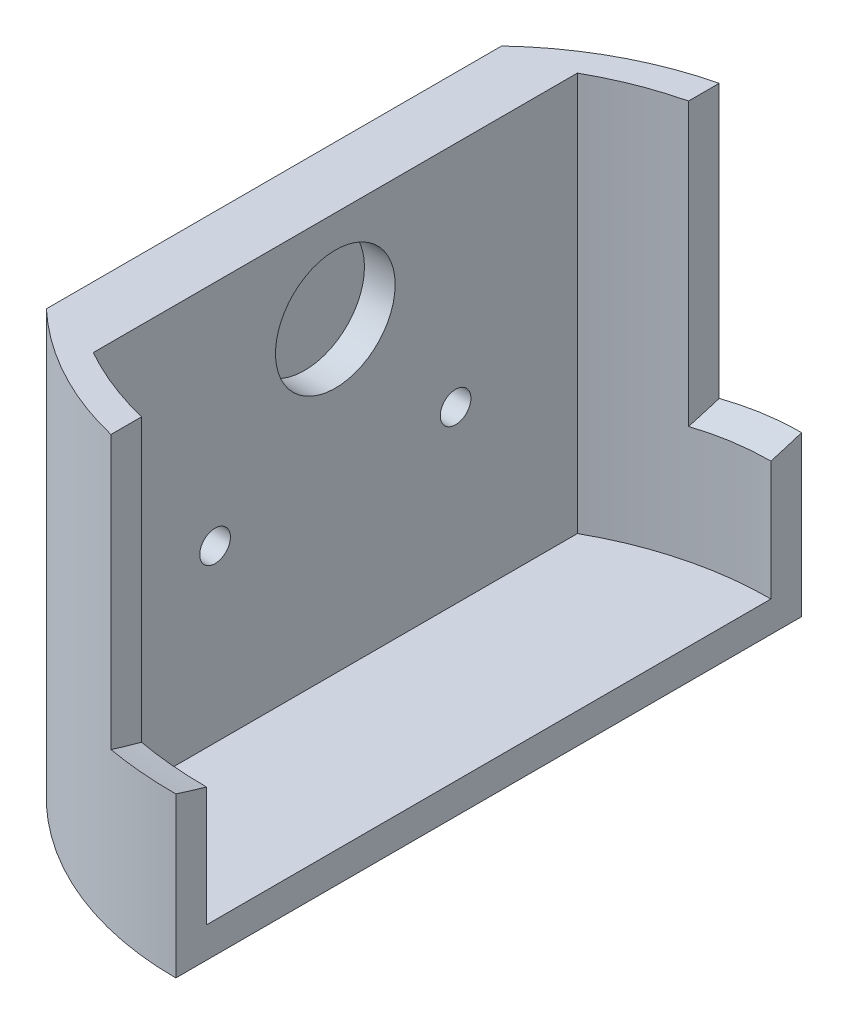
ISO-10303-21;
HEADER;
FILE_DESCRIPTION(('STEP AP214'),'2;1');
FILE_NAME('part.step','',(''),(''),'','','');
FILE_SCHEMA(('AUTOMOTIVE_DESIGN { 1 0 10303 214 1 1 1 1 }'));
ENDSEC;
DATA;
#1=APPLICATION_CONTEXT('core data for automotive mechanical design processes');
#2=APPLICATION_PROTOCOL_DEFINITION('international standard','automotive_design',2000,#1);
#3=PRODUCT_CONTEXT('',#1,'mechanical');
#4=PRODUCT('Part','Part','',(#3));
#5=PRODUCT_RELATED_PRODUCT_CATEGORY('part','',(#4));
#6=PRODUCT_DEFINITION_FORMATION('','',#4);
#7=PRODUCT_DEFINITION_CONTEXT('part definition',#1,'design');
#8=PRODUCT_DEFINITION('design','',#6,#7);
#9=PRODUCT_DEFINITION_SHAPE('','',#8);
#10=(LENGTH_UNIT() NAMED_UNIT(*) SI_UNIT(.MILLI.,.METRE.));
#11=(NAMED_UNIT(*) PLANE_ANGLE_UNIT() SI_UNIT($,.RADIAN.));
#12=(NAMED_UNIT(*) SI_UNIT($,.STERADIAN.) SOLID_ANGLE_UNIT());
#13=UNCERTAINTY_MEASURE_WITH_UNIT(LENGTH_MEASURE(1.E-05),#10,'distance_accuracy_value','');
#14=(GEOMETRIC_REPRESENTATION_CONTEXT(3) GLOBAL_UNCERTAINTY_ASSIGNED_CONTEXT((#13)) GLOBAL_UNIT_ASSIGNED_CONTEXT((#10,
#11,#12)) REPRESENTATION_CONTEXT('',''));
#15=CARTESIAN_POINT('',(0.,0.,0.));
#16=DIRECTION('',(0.,0.,1.));
#17=DIRECTION('',(1.,0.,0.));
#18=AXIS2_PLACEMENT_3D('',#15,#16,#17);
#19=CARTESIAN_POINT('',(0.,35.,0.));
#20=DIRECTION('',(0.,1.,0.));
#21=DIRECTION('',(0.,0.,1.));
#22=AXIS2_PLACEMENT_3D('',#19,#20,#21);
#23=PLANE('',#22);
#24=CARTESIAN_POINT('',(0.,35.,0.));
#25=DIRECTION('',(0.,1.,0.));
#26=DIRECTION('',(0.,0.,1.));
#27=AXIS2_PLACEMENT_3D('',#24,#25,#26);
#28=CIRCLE('',#27,51.);
#29=CARTESIAN_POINT('',(-35.,35.,37.0944739819828));
#30=VERTEX_POINT('',#29);
#31=CARTESIAN_POINT('',(-12.0000000000001,35.,49.5681349255749));
#32=VERTEX_POINT('',#31);
#33=EDGE_CURVE('E158',#30,#32,#28,.T.);
#34=ORIENTED_EDGE('',*,*,#33,.T.);
#35=DIRECTION('',(0.,0.,-1.));
#36=VECTOR('',#35,1.);
#37=CARTESIAN_POINT('',(-12.,35.,0.));
#38=LINE('',#37,#36);
#39=CARTESIAN_POINT('',(-12.0000000000001,35.,44.5681349255749));
#40=VERTEX_POINT('',#39);
#41=EDGE_CURVE('E11',#32,#40,#38,.T.);
#42=ORIENTED_EDGE('',*,*,#41,.T.);
#43=CARTESIAN_POINT('',(0.,35.,-5.00000000000011));
#44=DIRECTION('',(0.,1.,0.));
#45=DIRECTION('',(0.,0.,1.));
#46=AXIS2_PLACEMENT_3D('',#43,#44,#45);
#47=CIRCLE('',#46,51.0000000000001);
#48=CARTESIAN_POINT('',(-25.,35.,39.4522215417857));
#49=VERTEX_POINT('',#48);
#50=EDGE_CURVE('E204',#49,#40,#47,.T.);
#51=ORIENTED_EDGE('',*,*,#50,.F.);
#52=DIRECTION('',(0.,0.,1.));
#53=VECTOR('',#52,1.);
#54=CARTESIAN_POINT('',(-25.,35.,0.));
#55=LINE('',#54,#53);
#56=CARTESIAN_POINT('',(-25.,35.,-39.4522215417857));
#57=VERTEX_POINT('',#56);
#58=EDGE_CURVE('E192',#57,#49,#55,.T.);
#59=ORIENTED_EDGE('',*,*,#58,.F.);
#60=CARTESIAN_POINT('',(0.,35.,5.00000000000012));
#61=DIRECTION('',(0.,1.,0.));
#62=DIRECTION('',(0.,0.,1.));
#63=AXIS2_PLACEMENT_3D('',#60,#61,#62);
#64=CIRCLE('',#63,51.0000000000001);
#65=CARTESIAN_POINT('',(-11.9999999999999,35.,-44.5681349255749));
#66=VERTEX_POINT('',#65);
#67=EDGE_CURVE('E182',#57,#66,#64,.F.);
#68=ORIENTED_EDGE('',*,*,#67,.T.);
#69=CARTESIAN_POINT('',(-11.9999999999999,35.,-49.568134925575));
#70=VERTEX_POINT('',#69);
#71=EDGE_CURVE('E42',#66,#70,#38,.T.);
#72=ORIENTED_EDGE('',*,*,#71,.T.);
#73=CARTESIAN_POINT('',(0.,35.,0.));
#74=DIRECTION('',(0.,1.,0.));
#75=DIRECTION('',(0.,0.,1.));
#76=AXIS2_PLACEMENT_3D('',#73,#74,#75);
#77=CIRCLE('',#76,51.);
#78=CARTESIAN_POINT('',(-35.,35.,-37.0944739819828));
#79=VERTEX_POINT('',#78);
#80=EDGE_CURVE('E178',#70,#79,#77,.T.);
#81=ORIENTED_EDGE('',*,*,#80,.T.);
#82=DIRECTION('',(0.,0.,1.));
#83=VECTOR('',#82,1.);
#84=CARTESIAN_POINT('',(-35.,35.,0.));
#85=LINE('',#84,#83);
#86=EDGE_CURVE('E189',#79,#30,#85,.T.);
#87=ORIENTED_EDGE('',*,*,#86,.T.);
#88=EDGE_LOOP('',(#34,#42,#51,#59,#68,#72,#81,#87));
#89=FACE_BOUND('',#88,.T.);
#90=ADVANCED_FACE('F37',(#89),#23,.T.);
#91=CARTESIAN_POINT('',(0.,35.,-5.00000000000011));
#92=DIRECTION('',(0.,-1.,0.));
#93=DIRECTION('',(0.,0.,-1.));
#94=AXIS2_PLACEMENT_3D('',#91,#92,#93);
#95=CYLINDRICAL_SURFACE('',#94,51.0000000000001);
#96=CARTESIAN_POINT('',(0.,-10.5397147125907,46.));
#97=CARTESIAN_POINT('',(-1.01212666729296,-10.5396649263667,46.000046785484));
#98=CARTESIAN_POINT('',(-2.02424113794272,-10.5483477629724,45.9698708668592));
#99=CARTESIAN_POINT('',(-4.04078435592302,-10.5827391344307,45.8496532403654));
#100=CARTESIAN_POINT('',(-5.0452276935598,-10.6083832870093,45.7598379085058));
#101=CARTESIAN_POINT('',(-7.04645854770597,-10.6762630245179,45.5209160571074));
#102=CARTESIAN_POINT('',(-8.04324611476283,-10.718498499807,45.3718099293815));
#103=CARTESIAN_POINT('',(-10.0292422599076,-10.8189618364022,45.0143703287444));
#104=CARTESIAN_POINT('',(-11.0184078177535,-10.8772496793075,44.8058146107468));
#105=CARTESIAN_POINT('',(-12.0000000000001,-10.9430997255109,44.5681349255749));
#106=B_SPLINE_CURVE_WITH_KNOTS('',3,(#96,#97,#98,#99,#100,#101,#102,#103,#104,#105),
.UNSPECIFIED.,.F.,.F.,(4,2,2,2,4),(0.,3.0358740493823,6.06029006734916,9.0846860993236,
12.1205401790147),.UNSPECIFIED.);
#107=CARTESIAN_POINT('',(-1.0928748035591E-13,-10.5397147125907,46.));
#108=VERTEX_POINT('',#107);
#109=CARTESIAN_POINT('',(-12.0000000000001,-10.9430997255109,44.5681349255749));
#110=VERTEX_POINT('',#109);
#111=EDGE_CURVE('E230',#108,#110,#106,.T.);
#112=ORIENTED_EDGE('',*,*,#111,.F.);
#113=DIRECTION('',(0.,-1.,0.));
#114=VECTOR('',#113,1.);
#115=CARTESIAN_POINT('',(0.,35.,46.));
#116=LINE('',#115,#114);
#117=CARTESIAN_POINT('',(0.,-30.,46.));
#118=VERTEX_POINT('',#117);
#119=EDGE_CURVE('E146',#108,#118,#116,.T.);
#120=ORIENTED_EDGE('',*,*,#119,.T.);
#121=CARTESIAN_POINT('',(0.,-30.,-5.00000000000011));
#122=DIRECTION('',(0.,-1.,0.));
#123=DIRECTION('',(0.,0.,-1.));
#124=AXIS2_PLACEMENT_3D('',#121,#122,#123);
#125=CIRCLE('',#124,51.0000000000001);
#126=CARTESIAN_POINT('',(-25.,-30.,39.4522215417857));
#127=VERTEX_POINT('',#126);
#128=EDGE_CURVE('E200',#118,#127,#125,.T.);
#129=ORIENTED_EDGE('',*,*,#128,.T.);
#130=DIRECTION('',(0.,-1.,0.));
#131=VECTOR('',#130,1.);
#132=CARTESIAN_POINT('',(-25.,35.,39.4522215417857));
#133=LINE('',#132,#131);
#134=EDGE_CURVE('E169',#49,#127,#133,.T.);
#135=ORIENTED_EDGE('',*,*,#134,.F.);
#136=ORIENTED_EDGE('',*,*,#50,.T.);
#137=DIRECTION('',(0.,-1.,0.));
#138=VECTOR('',#137,1.);
#139=CARTESIAN_POINT('',(-12.0000000000001,35.,44.5681349255749));
#140=LINE('',#139,#138);
#141=EDGE_CURVE('E61',#40,#110,#140,.T.);
#142=ORIENTED_EDGE('',*,*,#141,.T.);
#143=EDGE_LOOP('',(#112,#120,#129,#135,#136,#142));
#144=FACE_BOUND('',#143,.T.);
#145=ADVANCED_FACE('F39',(#144),#95,.F.);
#146=CARTESIAN_POINT('',(-25.,35.,0.));
#147=DIRECTION('',(1.,0.,0.));
#148=DIRECTION('',(0.,0.,-1.));
#149=AXIS2_PLACEMENT_3D('',#146,#147,#148);
#150=PLANE('',#149);
#151=CARTESIAN_POINT('',(-25.,20.,0.));
#152=DIRECTION('',(1.,0.,0.));
#153=DIRECTION('',(0.,0.,-1.));
#154=AXIS2_PLACEMENT_3D('',#151,#152,#153);
#155=CIRCLE('',#154,9.75);
#156=CARTESIAN_POINT('',(-25.,20.,-9.75));
#157=VERTEX_POINT('',#156);
#158=EDGE_CURVE('E320',#157,#157,#155,.T.);
#159=ORIENTED_EDGE('',*,*,#158,.F.);
#160=EDGE_LOOP('',(#159));
#161=FACE_BOUND('',#160,.T.);
#162=CARTESIAN_POINT('',(-25.,-2.21,-19.6));
#163=DIRECTION('',(1.,0.,0.));
#164=DIRECTION('',(0.,0.,-1.));
#165=AXIS2_PLACEMENT_3D('',#162,#163,#164);
#166=CIRCLE('',#165,2.5);
#167=CARTESIAN_POINT('',(-25.,-2.21,-22.1));
#168=VERTEX_POINT('',#167);
#169=EDGE_CURVE('E224',#168,#168,#166,.T.);
#170=ORIENTED_EDGE('',*,*,#169,.F.);
#171=EDGE_LOOP('',(#170));
#172=FACE_BOUND('',#171,.T.);
#173=CARTESIAN_POINT('',(-25.,-2.21,19.6));
#174=DIRECTION('',(1.,0.,0.));
#175=DIRECTION('',(0.,0.,-1.));
#176=AXIS2_PLACEMENT_3D('',#173,#174,#175);
#177=CIRCLE('',#176,2.5);
#178=CARTESIAN_POINT('',(-25.,-2.21,17.1));
#179=VERTEX_POINT('',#178);
#180=EDGE_CURVE('E221',#179,#179,#177,.T.);
#181=ORIENTED_EDGE('',*,*,#180,.F.);
#182=EDGE_LOOP('',(#181));
#183=FACE_BOUND('',#182,.T.);
#184=ORIENTED_EDGE('',*,*,#134,.T.);
#185=DIRECTION('',(0.,0.,-1.));
#186=VECTOR('',#185,1.);
#187=CARTESIAN_POINT('',(-25.,-30.,0.));
#188=LINE('',#187,#186);
#189=CARTESIAN_POINT('',(-25.,-30.,-39.4522215417857));
#190=VERTEX_POINT('',#189);
#191=EDGE_CURVE('E213',#127,#190,#188,.T.);
#192=ORIENTED_EDGE('',*,*,#191,.T.);
#193=DIRECTION('',(0.,-1.,0.));
#194=VECTOR('',#193,1.);
#195=CARTESIAN_POINT('',(-25.,35.,-39.4522215417857));
#196=LINE('',#195,#194);
#197=EDGE_CURVE('E167',#57,#190,#196,.T.);
#198=ORIENTED_EDGE('',*,*,#197,.F.);
#199=ORIENTED_EDGE('',*,*,#58,.T.);
#200=EDGE_LOOP('',(#184,#192,#198,#199));
#201=FACE_BOUND('',#200,.T.);
#202=ADVANCED_FACE('F274',(#161,#172,#183,#201),#150,.T.);
#203=CARTESIAN_POINT('',(0.,35.,5.00000000000012));
#204=DIRECTION('',(0.,-1.,0.));
#205=DIRECTION('',(0.,0.,-1.));
#206=AXIS2_PLACEMENT_3D('',#203,#204,#205);
#207=CYLINDRICAL_SURFACE('',#206,51.0000000000001);
#208=DIRECTION('',(0.,-1.,0.));
#209=VECTOR('',#208,1.);
#210=CARTESIAN_POINT('',(0.,35.,-46.));
#211=LINE('',#210,#209);
#212=CARTESIAN_POINT('',(1.0928748035591E-13,-10.5397147125907,-46.));
#213=VERTEX_POINT('',#212);
#214=CARTESIAN_POINT('',(0.,-30.,-46.));
#215=VERTEX_POINT('',#214);
#216=EDGE_CURVE('E165',#213,#215,#211,.T.);
#217=ORIENTED_EDGE('',*,*,#216,.F.);
#218=CARTESIAN_POINT('',(0.,-10.5397147125907,-46.));
#219=CARTESIAN_POINT('',(-1.01212666729297,-10.5396649263668,-46.0000467854839));
#220=CARTESIAN_POINT('',(-2.02424113794271,-10.5483477629724,-45.9698708668592));
#221=CARTESIAN_POINT('',(-4.04078435592297,-10.5827391344307,-45.8496532403654));
#222=CARTESIAN_POINT('',(-5.04522769355972,-10.6083832870093,-45.7598379085058));
#223=CARTESIAN_POINT('',(-7.04645854770586,-10.6762630245179,-45.5209160571075));
#224=CARTESIAN_POINT('',(-8.0432461147627,-10.718498499807,-45.3718099293816));
#225=CARTESIAN_POINT('',(-10.0292422599074,-10.8189618364022,-45.0143703287444));
#226=CARTESIAN_POINT('',(-11.0184078177533,-10.8772496793075,-44.8058146107468));
#227=CARTESIAN_POINT('',(-11.9999999999999,-10.9430997255109,-44.5681349255749));
#228=B_SPLINE_CURVE_WITH_KNOTS('',3,(#218,#219,#220,#221,#222,#223,#224,#225,#226,#227),
.UNSPECIFIED.,.F.,.F.,(4,2,2,2,4),(0.,3.03587404938223,6.06029006734904,9.08468609932341,
12.1205401790145),.UNSPECIFIED.);
#229=CARTESIAN_POINT('',(-11.9999999999999,-10.9430997255109,-44.5681349255749));
#230=VERTEX_POINT('',#229);
#231=EDGE_CURVE('E238',#213,#230,#228,.T.);
#232=ORIENTED_EDGE('',*,*,#231,.T.);
#233=DIRECTION('',(0.,-1.,0.));
#234=VECTOR('',#233,1.);
#235=CARTESIAN_POINT('',(-11.9999999999999,35.,-44.5681349255749));
#236=LINE('',#235,#234);
#237=EDGE_CURVE('E317',#66,#230,#236,.T.);
#238=ORIENTED_EDGE('',*,*,#237,.F.);
#239=ORIENTED_EDGE('',*,*,#67,.F.);
#240=ORIENTED_EDGE('',*,*,#197,.T.);
#241=CARTESIAN_POINT('',(0.,-30.,5.00000000000012));
#242=DIRECTION('',(0.,-1.,0.));
#243=DIRECTION('',(0.,0.,-1.));
#244=AXIS2_PLACEMENT_3D('',#241,#242,#243);
#245=CIRCLE('',#244,51.0000000000001);
#246=EDGE_CURVE('E215',#215,#190,#245,.F.);
#247=ORIENTED_EDGE('',*,*,#246,.F.);
#248=EDGE_LOOP('',(#217,#232,#238,#239,#240,#247));
#249=FACE_BOUND('',#248,.T.);
#250=ADVANCED_FACE('F271',(#249),#207,.F.);
#251=CARTESIAN_POINT('',(0.,35.,0.));
#252=DIRECTION('',(0.,-1.,0.));
#253=DIRECTION('',(0.,0.,-1.));
#254=AXIS2_PLACEMENT_3D('',#251,#252,#253);
#255=CYLINDRICAL_SURFACE('',#254,51.);
#256=DIRECTION('',(0.,-1.,0.));
#257=VECTOR('',#256,1.);
#258=CARTESIAN_POINT('',(-11.9999999999999,35.,-49.568134925575));
#259=LINE('',#258,#257);
#260=CARTESIAN_POINT('',(-11.9999999999999,-9.47413583399659,-49.568134925575));
#261=VERTEX_POINT('',#260);
#262=EDGE_CURVE('E53',#261,#70,#259,.F.);
#263=ORIENTED_EDGE('',*,*,#262,.F.);
#264=CARTESIAN_POINT('',(-11.9999999999999,-9.47413583399659,-49.568134925575));
#265=CARTESIAN_POINT('',(-11.0187112812139,-9.40024670806549,-49.8057425278275));
#266=CARTESIAN_POINT('',(-10.029754786055,-9.33488450134017,-50.0142660983863));
#267=CARTESIAN_POINT('',(-8.04404278182525,-9.22227224124399,-50.3716784635086));
#268=CARTESIAN_POINT('',(-7.04733183091364,-9.17495356991025,-50.5207932832916));
#269=CARTESIAN_POINT('',(-5.04604258320943,-9.098906030237,-50.7597591208243));
#270=CARTESIAN_POINT('',(-4.0414642234755,-9.07017731077604,-50.8496096639533));
#271=CARTESIAN_POINT('',(-2.5298521156747,-9.04133057275696,-50.939730050804));
#272=CARTESIAN_POINT('',(-2.02418633564615,-9.03408926252952,-50.9623277897414));
#273=CARTESIAN_POINT('',(-1.01235826531961,-9.02442831421355,-50.992463156473));
#274=CARTESIAN_POINT('',(-0.50619597308539,-9.02200869500345,-51.0000007253019));
#275=CARTESIAN_POINT('',(0.,-9.02201105507375,-51.));
#276=B_SPLINE_CURVE_WITH_KNOTS('',3,(#264,#265,#266,#267,#268,#269,#270,#271,#272,#273,#274,
#275),.UNSPECIFIED.,.F.,.F.,(4,2,2,2,2,4),(0.,3.03651662250019,6.06136765875275,
9.08624291937569,10.6046958249614,12.1231546757575),.UNSPECIFIED.);
#277=CARTESIAN_POINT('',(1.21166554307639E-13,-9.02201105507375,-51.));
#278=VERTEX_POINT('',#277);
#279=EDGE_CURVE('E137',#261,#278,#276,.T.);
#280=ORIENTED_EDGE('',*,*,#279,.T.);
#281=DIRECTION('',(0.,-1.,0.));
#282=VECTOR('',#281,1.);
#283=CARTESIAN_POINT('',(0.,35.,-51.));
#284=LINE('',#283,#282);
#285=CARTESIAN_POINT('',(0.,-35.,-51.));
#286=VERTEX_POINT('',#285);
#287=EDGE_CURVE('E163',#278,#286,#284,.T.);
#288=ORIENTED_EDGE('',*,*,#287,.T.);
#289=CARTESIAN_POINT('',(0.,-35.,0.));
#290=DIRECTION('',(0.,1.,0.));
#291=DIRECTION('',(0.,0.,1.));
#292=AXIS2_PLACEMENT_3D('',#289,#290,#291);
#293=CIRCLE('',#292,51.);
#294=CARTESIAN_POINT('',(-35.,-35.,-37.0944739819828));
#295=VERTEX_POINT('',#294);
#296=EDGE_CURVE('E197',#286,#295,#293,.T.);
#297=ORIENTED_EDGE('',*,*,#296,.T.);
#298=DIRECTION('',(0.,-1.,0.));
#299=VECTOR('',#298,1.);
#300=CARTESIAN_POINT('',(-35.,35.,-37.0944739819828));
#301=LINE('',#300,#299);
#302=EDGE_CURVE('E156',#79,#295,#301,.T.);
#303=ORIENTED_EDGE('',*,*,#302,.F.);
#304=ORIENTED_EDGE('',*,*,#80,.F.);
#305=EDGE_LOOP('',(#263,#280,#288,#297,#303,#304));
#306=FACE_BOUND('',#305,.T.);
#307=ADVANCED_FACE('F185',(#306),#255,.T.);
#308=CARTESIAN_POINT('',(-35.,35.,0.));
#309=DIRECTION('',(1.,0.,0.));
#310=DIRECTION('',(0.,0.,-1.));
#311=AXIS2_PLACEMENT_3D('',#308,#309,#310);
#312=PLANE('',#311);
#313=DIRECTION('',(0.,0.,1.));
#314=VECTOR('',#313,1.);
#315=CARTESIAN_POINT('',(-35.,-35.,0.));
#316=LINE('',#315,#314);
#317=CARTESIAN_POINT('',(-35.,-35.,37.0944739819828));
#318=VERTEX_POINT('',#317);
#319=EDGE_CURVE('E199',#295,#318,#316,.T.);
#320=ORIENTED_EDGE('',*,*,#319,.T.);
#321=DIRECTION('',(0.,-1.,0.));
#322=VECTOR('',#321,1.);
#323=CARTESIAN_POINT('',(-35.,35.,37.0944739819828));
#324=LINE('',#323,#322);
#325=EDGE_CURVE('E154',#30,#318,#324,.T.);
#326=ORIENTED_EDGE('',*,*,#325,.F.);
#327=ORIENTED_EDGE('',*,*,#86,.F.);
#328=ORIENTED_EDGE('',*,*,#302,.T.);
#329=EDGE_LOOP('',(#320,#326,#327,#328));
#330=FACE_BOUND('',#329,.T.);
#331=ADVANCED_FACE('F270',(#330),#312,.F.);
#332=CARTESIAN_POINT('',(0.,35.,0.));
#333=DIRECTION('',(0.,-1.,0.));
#334=DIRECTION('',(0.,0.,-1.));
#335=AXIS2_PLACEMENT_3D('',#332,#333,#334);
#336=CYLINDRICAL_SURFACE('',#335,51.);
#337=DIRECTION('',(0.,-1.,0.));
#338=VECTOR('',#337,1.);
#339=CARTESIAN_POINT('',(0.,35.,51.));
#340=LINE('',#339,#338);
#341=CARTESIAN_POINT('',(-1.21166554307639E-13,-9.02201105507375,51.));
#342=VERTEX_POINT('',#341);
#343=CARTESIAN_POINT('',(0.,-35.,51.));
#344=VERTEX_POINT('',#343);
#345=EDGE_CURVE('E143',#342,#344,#340,.T.);
#346=ORIENTED_EDGE('',*,*,#345,.F.);
#347=CARTESIAN_POINT('',(0.,-9.02201105507375,51.));
#348=CARTESIAN_POINT('',(-0.506195973085392,-9.02200869500345,51.0000007253019));
#349=CARTESIAN_POINT('',(-1.01235826531963,-9.02442831421355,50.992463156473));
#350=CARTESIAN_POINT('',(-2.02418633564618,-9.03408926252952,50.9623277897414));
#351=CARTESIAN_POINT('',(-2.52985211567474,-9.04133057275695,50.939730050804));
#352=CARTESIAN_POINT('',(-4.04146422347557,-9.07017731077603,50.8496096639533));
#353=CARTESIAN_POINT('',(-5.04604258320952,-9.09890603023699,50.7597591208243));
#354=CARTESIAN_POINT('',(-7.04733183091377,-9.17495356991025,50.5207932832916));
#355=CARTESIAN_POINT('',(-8.0440427818254,-9.22227224124399,50.3716784635086));
#356=CARTESIAN_POINT('',(-10.0297547860552,-9.33488450134017,50.0142660983863));
#357=CARTESIAN_POINT('',(-11.0187112812141,-9.40024670806549,49.8057425278274));
#358=CARTESIAN_POINT('',(-12.0000000000001,-9.47413583399659,49.5681349255749));
#359=B_SPLINE_CURVE_WITH_KNOTS('',3,(#347,#348,#349,#350,#351,#352,#353,#354,#355,#356,#357,
#358),.UNSPECIFIED.,.F.,.F.,(4,2,2,2,2,4),(0.,1.51845885079609,3.03691175638185,
6.06178701700485,9.08663805325746,12.1231546757577),.UNSPECIFIED.);
#360=CARTESIAN_POINT('',(-12.0000000000001,-9.47413583399659,49.5681349255749));
#361=VERTEX_POINT('',#360);
#362=EDGE_CURVE('E128',#342,#361,#359,.T.);
#363=ORIENTED_EDGE('',*,*,#362,.T.);
#364=DIRECTION('',(0.,-1.,0.));
#365=VECTOR('',#364,1.);
#366=CARTESIAN_POINT('',(-12.0000000000001,35.,49.5681349255749));
#367=LINE('',#366,#365);
#368=EDGE_CURVE('E315',#32,#361,#367,.T.);
#369=ORIENTED_EDGE('',*,*,#368,.F.);
#370=ORIENTED_EDGE('',*,*,#33,.F.);
#371=ORIENTED_EDGE('',*,*,#325,.T.);
#372=CARTESIAN_POINT('',(0.,-35.,0.));
#373=DIRECTION('',(0.,1.,0.));
#374=DIRECTION('',(0.,0.,1.));
#375=AXIS2_PLACEMENT_3D('',#372,#373,#374);
#376=CIRCLE('',#375,51.);
#377=EDGE_CURVE('E152',#318,#344,#376,.T.);
#378=ORIENTED_EDGE('',*,*,#377,.T.);
#379=EDGE_LOOP('',(#346,#363,#369,#370,#371,#378));
#380=FACE_BOUND('',#379,.T.);
#381=ADVANCED_FACE('F150',(#380),#336,.T.);
#382=CARTESIAN_POINT('',(1.21166554307639E-13,35.,0.));
#383=DIRECTION('',(1.,0.,0.));
#384=DIRECTION('',(0.,0.,-1.));
#385=AXIS2_PLACEMENT_3D('',#382,#383,#384);
#386=PLANE('',#385);
#387=CARTESIAN_POINT('',(0.,150.,0.));
#388=DIRECTION('',(1.,0.,0.));
#389=DIRECTION('',(0.,0.,-1.));
#390=AXIS2_PLACEMENT_3D('',#387,#388,#389);
#391=CIRCLE('',#390,167.);
#392=EDGE_CURVE('E131',#342,#108,#391,.T.);
#393=ORIENTED_EDGE('',*,*,#392,.F.);
#394=ORIENTED_EDGE('',*,*,#345,.T.);
#395=DIRECTION('',(0.,0.,1.));
#396=VECTOR('',#395,1.);
#397=CARTESIAN_POINT('',(1.21166554307639E-13,-35.,0.));
#398=LINE('',#397,#396);
#399=EDGE_CURVE('E203',#286,#344,#398,.T.);
#400=ORIENTED_EDGE('',*,*,#399,.F.);
#401=ORIENTED_EDGE('',*,*,#287,.F.);
#402=EDGE_CURVE('E148',#213,#278,#391,.T.);
#403=ORIENTED_EDGE('',*,*,#402,.F.);
#404=ORIENTED_EDGE('',*,*,#216,.T.);
#405=DIRECTION('',(0.,0.,1.));
#406=VECTOR('',#405,1.);
#407=CARTESIAN_POINT('',(0.,-30.,51.));
#408=LINE('',#407,#406);
#409=EDGE_CURVE('E218',#215,#118,#408,.T.);
#410=ORIENTED_EDGE('',*,*,#409,.T.);
#411=ORIENTED_EDGE('',*,*,#119,.F.);
#412=EDGE_LOOP('',(#393,#394,#400,#401,#403,#404,#410,#411));
#413=FACE_BOUND('',#412,.T.);
#414=ADVANCED_FACE('F141',(#413),#386,.T.);
#415=CARTESIAN_POINT('',(0.,-35.,0.));
#416=DIRECTION('',(0.,1.,0.));
#417=DIRECTION('',(0.,0.,1.));
#418=AXIS2_PLACEMENT_3D('',#415,#416,#417);
#419=PLANE('',#418);
#420=ORIENTED_EDGE('',*,*,#296,.F.);
#421=ORIENTED_EDGE('',*,*,#399,.T.);
#422=ORIENTED_EDGE('',*,*,#377,.F.);
#423=ORIENTED_EDGE('',*,*,#319,.F.);
#424=EDGE_LOOP('',(#420,#421,#422,#423));
#425=FACE_BOUND('',#424,.T.);
#426=ADVANCED_FACE('F291',(#425),#419,.F.);
#427=CARTESIAN_POINT('',(0.,-30.,0.));
#428=DIRECTION('',(0.,-1.,0.));
#429=DIRECTION('',(0.,0.,-1.));
#430=AXIS2_PLACEMENT_3D('',#427,#428,#429);
#431=PLANE('',#430);
#432=ORIENTED_EDGE('',*,*,#128,.F.);
#433=ORIENTED_EDGE('',*,*,#409,.F.);
#434=ORIENTED_EDGE('',*,*,#246,.T.);
#435=ORIENTED_EDGE('',*,*,#191,.F.);
#436=EDGE_LOOP('',(#432,#433,#434,#435));
#437=FACE_BOUND('',#436,.T.);
#438=ADVANCED_FACE('F289',(#437),#431,.F.);
#439=CARTESIAN_POINT('',(-30.,-2.21,19.6));
#440=DIRECTION('',(1.,0.,0.));
#441=DIRECTION('',(0.,0.,-1.));
#442=AXIS2_PLACEMENT_3D('',#439,#440,#441);
#443=CYLINDRICAL_SURFACE('',#442,2.5);
#444=CARTESIAN_POINT('',(-30.,-2.21,19.6));
#445=DIRECTION('',(1.,0.,0.));
#446=DIRECTION('',(0.,0.,-1.));
#447=AXIS2_PLACEMENT_3D('',#444,#445,#446);
#448=CIRCLE('',#447,2.5);
#449=CARTESIAN_POINT('',(-30.,-2.21,17.1));
#450=VERTEX_POINT('',#449);
#451=EDGE_CURVE('E220',#450,#450,#448,.T.);
#452=ORIENTED_EDGE('',*,*,#451,.F.);
#453=EDGE_LOOP('',(#452));
#454=FACE_BOUND('',#453,.T.);
#455=ORIENTED_EDGE('',*,*,#180,.T.);
#456=EDGE_LOOP('',(#455));
#457=FACE_BOUND('',#456,.T.);
#458=ADVANCED_FACE('F414',(#454,#457),#443,.F.);
#459=CARTESIAN_POINT('',(-30.,-2.21,19.6));
#460=DIRECTION('',(1.,0.,0.));
#461=DIRECTION('',(0.,0.,-1.));
#462=AXIS2_PLACEMENT_3D('',#459,#460,#461);
#463=PLANE('',#462);
#464=ORIENTED_EDGE('',*,*,#451,.T.);
#465=EDGE_LOOP('',(#464));
#466=FACE_BOUND('',#465,.T.);
#467=ADVANCED_FACE('F405',(#466),#463,.T.);
#468=CARTESIAN_POINT('',(-30.,-2.21,-19.6));
#469=DIRECTION('',(1.,0.,0.));
#470=DIRECTION('',(0.,0.,-1.));
#471=AXIS2_PLACEMENT_3D('',#468,#469,#470);
#472=CYLINDRICAL_SURFACE('',#471,2.5);
#473=CARTESIAN_POINT('',(-30.,-2.21,-19.6));
#474=DIRECTION('',(1.,0.,0.));
#475=DIRECTION('',(0.,0.,-1.));
#476=AXIS2_PLACEMENT_3D('',#473,#474,#475);
#477=CIRCLE('',#476,2.5);
#478=CARTESIAN_POINT('',(-30.,-2.21,-22.1));
#479=VERTEX_POINT('',#478);
#480=EDGE_CURVE('E227',#479,#479,#477,.T.);
#481=ORIENTED_EDGE('',*,*,#480,.F.);
#482=EDGE_LOOP('',(#481));
#483=FACE_BOUND('',#482,.T.);
#484=ORIENTED_EDGE('',*,*,#169,.T.);
#485=EDGE_LOOP('',(#484));
#486=FACE_BOUND('',#485,.T.);
#487=ADVANCED_FACE('F253',(#483,#486),#472,.F.);
#488=CARTESIAN_POINT('',(-30.,-2.21,-19.6));
#489=DIRECTION('',(1.,0.,0.));
#490=DIRECTION('',(0.,0.,-1.));
#491=AXIS2_PLACEMENT_3D('',#488,#489,#490);
#492=PLANE('',#491);
#493=ORIENTED_EDGE('',*,*,#480,.T.);
#494=EDGE_LOOP('',(#493));
#495=FACE_BOUND('',#494,.T.);
#496=ADVANCED_FACE('F326',(#495),#492,.T.);
#497=CARTESIAN_POINT('',(-12.,0.,0.));
#498=DIRECTION('',(1.,0.,0.));
#499=DIRECTION('',(0.,0.,-1.));
#500=AXIS2_PLACEMENT_3D('',#497,#498,#499);
#501=PLANE('',#500);
#502=ORIENTED_EDGE('',*,*,#237,.T.);
#503=CARTESIAN_POINT('',(-12.,150.,0.));
#504=DIRECTION('',(1.,0.,0.));
#505=DIRECTION('',(0.,0.,-1.));
#506=AXIS2_PLACEMENT_3D('',#503,#504,#505);
#507=CIRCLE('',#506,167.);
#508=EDGE_CURVE('E147',#230,#261,#507,.T.);
#509=ORIENTED_EDGE('',*,*,#508,.T.);
#510=ORIENTED_EDGE('',*,*,#262,.T.);
#511=ORIENTED_EDGE('',*,*,#71,.F.);
#512=EDGE_LOOP('',(#502,#509,#510,#511));
#513=FACE_BOUND('',#512,.T.);
#514=ADVANCED_FACE('F249',(#513),#501,.T.);
#515=CARTESIAN_POINT('',(-12.,150.,0.));
#516=DIRECTION('',(1.,0.,0.));
#517=DIRECTION('',(0.,0.,-1.));
#518=AXIS2_PLACEMENT_3D('',#515,#516,#517);
#519=CYLINDRICAL_SURFACE('',#518,167.);
#520=ORIENTED_EDGE('',*,*,#402,.T.);
#521=ORIENTED_EDGE('',*,*,#279,.F.);
#522=ORIENTED_EDGE('',*,*,#508,.F.);
#523=ORIENTED_EDGE('',*,*,#231,.F.);
#524=EDGE_LOOP('',(#520,#521,#522,#523));
#525=FACE_BOUND('',#524,.T.);
#526=ADVANCED_FACE('F244',(#525),#519,.F.);
#527=ORIENTED_EDGE('',*,*,#111,.T.);
#528=EDGE_CURVE('E133',#361,#110,#507,.T.);
#529=ORIENTED_EDGE('',*,*,#528,.F.);
#530=ORIENTED_EDGE('',*,*,#362,.F.);
#531=ORIENTED_EDGE('',*,*,#392,.T.);
#532=EDGE_LOOP('',(#527,#529,#530,#531));
#533=FACE_BOUND('',#532,.T.);
#534=ADVANCED_FACE('F130',(#533),#519,.F.);
#535=ORIENTED_EDGE('',*,*,#41,.F.);
#536=ORIENTED_EDGE('',*,*,#368,.T.);
#537=ORIENTED_EDGE('',*,*,#528,.T.);
#538=ORIENTED_EDGE('',*,*,#141,.F.);
#539=EDGE_LOOP('',(#535,#536,#537,#538));
#540=FACE_BOUND('',#539,.T.);
#541=ADVANCED_FACE('F251',(#540),#501,.T.);
#542=CARTESIAN_POINT('',(-30.,20.,0.));
#543=DIRECTION('',(1.,0.,0.));
#544=DIRECTION('',(0.,0.,-1.));
#545=AXIS2_PLACEMENT_3D('',#542,#543,#544);
#546=CYLINDRICAL_SURFACE('',#545,9.75);
#547=CARTESIAN_POINT('',(-30.,20.,0.));
#548=DIRECTION('',(1.,0.,0.));
#549=DIRECTION('',(0.,0.,-1.));
#550=AXIS2_PLACEMENT_3D('',#547,#548,#549);
#551=CIRCLE('',#550,9.75);
#552=CARTESIAN_POINT('',(-30.,20.,-9.75));
#553=VERTEX_POINT('',#552);
#554=EDGE_CURVE('E310',#553,#553,#551,.T.);
#555=ORIENTED_EDGE('',*,*,#554,.F.);
#556=EDGE_LOOP('',(#555));
#557=FACE_BOUND('',#556,.T.);
#558=ORIENTED_EDGE('',*,*,#158,.T.);
#559=EDGE_LOOP('',(#558));
#560=FACE_BOUND('',#559,.T.);
#561=ADVANCED_FACE('F332',(#557,#560),#546,.F.);
#562=CARTESIAN_POINT('',(-30.,20.,0.));
#563=DIRECTION('',(1.,0.,0.));
#564=DIRECTION('',(0.,0.,-1.));
#565=AXIS2_PLACEMENT_3D('',#562,#563,#564);
#566=PLANE('',#565);
#567=ORIENTED_EDGE('',*,*,#554,.T.);
#568=EDGE_LOOP('',(#567));
#569=FACE_BOUND('',#568,.T.);
#570=ADVANCED_FACE('F337',(#569),#566,.T.);
#571=CLOSED_SHELL('',(#90,#145,#202,#250,#307,#331,#381,#414,#426,#438,#458,#467,#487,#496,#514,
#526,#534,#541,#561,#570));
#572=MANIFOLD_SOLID_BREP('B2',#571);
#573=ADVANCED_BREP_SHAPE_REPRESENTATION('',(#18,#572),#14);
#574=SHAPE_DEFINITION_REPRESENTATION(#9,#573);
ENDSEC;
END-ISO-10303-21;
